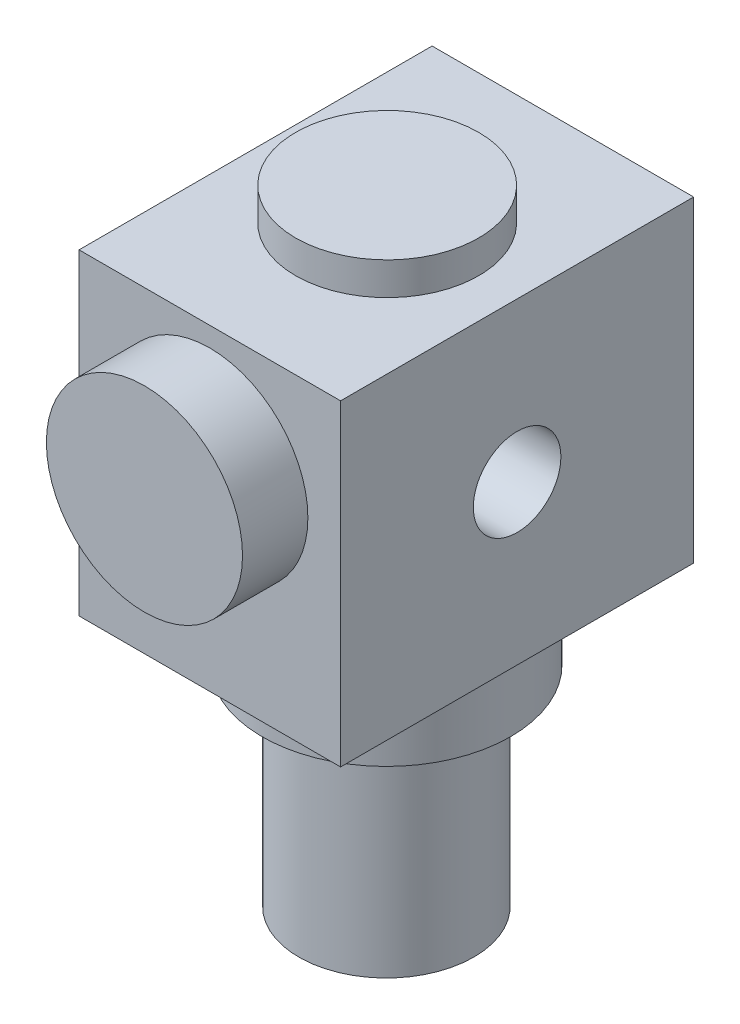
ISO-10303-21;
HEADER;
FILE_DESCRIPTION(('STEP AP214'),'2;1');
FILE_NAME('part.step','',(''),(''),'','','');
FILE_SCHEMA(('AUTOMOTIVE_DESIGN { 1 0 10303 214 1 1 1 1 }'));
ENDSEC;
DATA;
#1=APPLICATION_CONTEXT('core data for automotive mechanical design processes');
#2=APPLICATION_PROTOCOL_DEFINITION('international standard','automotive_design',2000,#1);
#3=PRODUCT_CONTEXT('',#1,'mechanical');
#4=PRODUCT('Part','Part','',(#3));
#5=PRODUCT_RELATED_PRODUCT_CATEGORY('part','',(#4));
#6=PRODUCT_DEFINITION_FORMATION('','',#4);
#7=PRODUCT_DEFINITION_CONTEXT('part definition',#1,'design');
#8=PRODUCT_DEFINITION('design','',#6,#7);
#9=PRODUCT_DEFINITION_SHAPE('','',#8);
#10=(LENGTH_UNIT() NAMED_UNIT(*) SI_UNIT(.MILLI.,.METRE.));
#11=(NAMED_UNIT(*) PLANE_ANGLE_UNIT() SI_UNIT($,.RADIAN.));
#12=(NAMED_UNIT(*) SI_UNIT($,.STERADIAN.) SOLID_ANGLE_UNIT());
#13=UNCERTAINTY_MEASURE_WITH_UNIT(LENGTH_MEASURE(1.E-05),#10,'distance_accuracy_value','');
#14=(GEOMETRIC_REPRESENTATION_CONTEXT(3) GLOBAL_UNCERTAINTY_ASSIGNED_CONTEXT((#13)) GLOBAL_UNIT_ASSIGNED_CONTEXT((#10,
#11,#12)) REPRESENTATION_CONTEXT('',''));
#15=CARTESIAN_POINT('',(0.,0.,0.));
#16=DIRECTION('',(0.,0.,1.));
#17=DIRECTION('',(1.,0.,0.));
#18=AXIS2_PLACEMENT_3D('',#15,#16,#17);
#19=CARTESIAN_POINT('',(-20.,24.25,54.));
#20=DIRECTION('',(0.,-1.,0.));
#21=DIRECTION('',(0.,0.,-1.));
#22=AXIS2_PLACEMENT_3D('',#19,#20,#21);
#23=PLANE('',#22);
#24=CARTESIAN_POINT('',(0.,24.25,26.8732665768881));
#25=DIRECTION('',(0.,1.,0.));
#26=DIRECTION('',(0.,0.,1.));
#27=AXIS2_PLACEMENT_3D('',#24,#25,#26);
#28=CIRCLE('',#27,14.);
#29=CARTESIAN_POINT('',(0.,24.25,40.8732665768881));
#30=VERTEX_POINT('',#29);
#31=EDGE_CURVE('E142',#30,#30,#28,.T.);
#32=ORIENTED_EDGE('',*,*,#31,.F.);
#33=EDGE_LOOP('',(#32));
#34=FACE_BOUND('',#33,.T.);
#35=DIRECTION('',(-1.,0.,0.));
#36=VECTOR('',#35,1.);
#37=CARTESIAN_POINT('',(-20.,24.25,0.));
#38=LINE('',#37,#36);
#39=CARTESIAN_POINT('',(20.,24.25,0.));
#40=VERTEX_POINT('',#39);
#41=CARTESIAN_POINT('',(-20.,24.25,0.));
#42=VERTEX_POINT('',#41);
#43=EDGE_CURVE('E117',#40,#42,#38,.T.);
#44=ORIENTED_EDGE('',*,*,#43,.T.);
#45=DIRECTION('',(0.,0.,-1.));
#46=VECTOR('',#45,1.);
#47=CARTESIAN_POINT('',(-20.,24.25,54.));
#48=LINE('',#47,#46);
#49=CARTESIAN_POINT('',(-20.,24.25,54.));
#50=VERTEX_POINT('',#49);
#51=EDGE_CURVE('E48',#50,#42,#48,.T.);
#52=ORIENTED_EDGE('',*,*,#51,.F.);
#53=DIRECTION('',(-1.,0.,0.));
#54=VECTOR('',#53,1.);
#55=CARTESIAN_POINT('',(-20.,24.25,54.));
#56=LINE('',#55,#54);
#57=CARTESIAN_POINT('',(20.,24.25,54.));
#58=VERTEX_POINT('',#57);
#59=EDGE_CURVE('E100',#58,#50,#56,.T.);
#60=ORIENTED_EDGE('',*,*,#59,.F.);
#61=DIRECTION('',(0.,0.,-1.));
#62=VECTOR('',#61,1.);
#63=CARTESIAN_POINT('',(20.,24.25,54.));
#64=LINE('',#63,#62);
#65=EDGE_CURVE('E113',#58,#40,#64,.T.);
#66=ORIENTED_EDGE('',*,*,#65,.T.);
#67=EDGE_LOOP('',(#44,#52,#60,#66));
#68=FACE_BOUND('',#67,.T.);
#69=ADVANCED_FACE('F45',(#34,#68),#23,.F.);
#70=CARTESIAN_POINT('',(-20.,-24.25,54.));
#71=DIRECTION('',(1.,0.,0.));
#72=DIRECTION('',(0.,0.,-1.));
#73=AXIS2_PLACEMENT_3D('',#70,#71,#72);
#74=PLANE('',#73);
#75=CARTESIAN_POINT('',(-20.,0.,27.));
#76=DIRECTION('',(-1.,0.,0.));
#77=DIRECTION('',(0.,0.,1.));
#78=AXIS2_PLACEMENT_3D('',#75,#76,#77);
#79=CIRCLE('',#78,6.7);
#80=CARTESIAN_POINT('',(-20.,0.,33.7));
#81=VERTEX_POINT('',#80);
#82=EDGE_CURVE('E168',#81,#81,#79,.T.);
#83=ORIENTED_EDGE('',*,*,#82,.F.);
#84=EDGE_LOOP('',(#83));
#85=FACE_BOUND('',#84,.T.);
#86=DIRECTION('',(0.,-1.,0.));
#87=VECTOR('',#86,1.);
#88=CARTESIAN_POINT('',(-20.,-24.25,0.));
#89=LINE('',#88,#87);
#90=CARTESIAN_POINT('',(-20.,-24.25,0.));
#91=VERTEX_POINT('',#90);
#92=EDGE_CURVE('E106',#42,#91,#89,.T.);
#93=ORIENTED_EDGE('',*,*,#92,.T.);
#94=DIRECTION('',(0.,0.,-1.));
#95=VECTOR('',#94,1.);
#96=CARTESIAN_POINT('',(-20.,-24.25,54.));
#97=LINE('',#96,#95);
#98=CARTESIAN_POINT('',(-20.,-24.25,54.));
#99=VERTEX_POINT('',#98);
#100=EDGE_CURVE('E104',#99,#91,#97,.T.);
#101=ORIENTED_EDGE('',*,*,#100,.F.);
#102=DIRECTION('',(0.,-1.,0.));
#103=VECTOR('',#102,1.);
#104=CARTESIAN_POINT('',(-20.,-24.25,54.));
#105=LINE('',#104,#103);
#106=EDGE_CURVE('E95',#50,#99,#105,.T.);
#107=ORIENTED_EDGE('',*,*,#106,.F.);
#108=ORIENTED_EDGE('',*,*,#51,.T.);
#109=EDGE_LOOP('',(#93,#101,#107,#108));
#110=FACE_BOUND('',#109,.T.);
#111=ADVANCED_FACE('F105',(#85,#110),#74,.F.);
#112=CARTESIAN_POINT('',(-20.,-24.25,54.));
#113=DIRECTION('',(0.,1.,0.));
#114=DIRECTION('',(-1.,0.,0.));
#115=AXIS2_PLACEMENT_3D('',#112,#113,#114);
#116=PLANE('',#115);
#117=CARTESIAN_POINT('',(0.,-24.25,27.));
#118=DIRECTION('',(0.,-1.,0.));
#119=DIRECTION('',(1.,0.,0.));
#120=AXIS2_PLACEMENT_3D('',#117,#118,#119);
#121=CIRCLE('',#120,19.);
#122=CARTESIAN_POINT('',(19.,-24.25,27.));
#123=VERTEX_POINT('',#122);
#124=EDGE_CURVE('E55',#123,#123,#121,.T.);
#125=ORIENTED_EDGE('',*,*,#124,.F.);
#126=EDGE_LOOP('',(#125));
#127=FACE_BOUND('',#126,.T.);
#128=DIRECTION('',(1.,0.,0.));
#129=VECTOR('',#128,1.);
#130=CARTESIAN_POINT('',(-20.,-24.25,0.));
#131=LINE('',#130,#129);
#132=CARTESIAN_POINT('',(20.,-24.25,0.));
#133=VERTEX_POINT('',#132);
#134=EDGE_CURVE('E81',#91,#133,#131,.T.);
#135=ORIENTED_EDGE('',*,*,#134,.T.);
#136=DIRECTION('',(0.,0.,-1.));
#137=VECTOR('',#136,1.);
#138=CARTESIAN_POINT('',(20.,-24.25,54.));
#139=LINE('',#138,#137);
#140=CARTESIAN_POINT('',(20.,-24.25,54.));
#141=VERTEX_POINT('',#140);
#142=EDGE_CURVE('E108',#141,#133,#139,.T.);
#143=ORIENTED_EDGE('',*,*,#142,.F.);
#144=DIRECTION('',(1.,0.,0.));
#145=VECTOR('',#144,1.);
#146=CARTESIAN_POINT('',(-20.,-24.25,54.));
#147=LINE('',#146,#145);
#148=EDGE_CURVE('E98',#99,#141,#147,.T.);
#149=ORIENTED_EDGE('',*,*,#148,.F.);
#150=ORIENTED_EDGE('',*,*,#100,.T.);
#151=EDGE_LOOP('',(#135,#143,#149,#150));
#152=FACE_BOUND('',#151,.T.);
#153=ADVANCED_FACE('F109',(#127,#152),#116,.F.);
#154=CARTESIAN_POINT('',(20.,-24.25,54.));
#155=DIRECTION('',(-1.,0.,0.));
#156=DIRECTION('',(0.,0.,1.));
#157=AXIS2_PLACEMENT_3D('',#154,#155,#156);
#158=PLANE('',#157);
#159=CARTESIAN_POINT('',(20.,0.,27.));
#160=DIRECTION('',(1.,0.,0.));
#161=DIRECTION('',(0.,0.,-1.));
#162=AXIS2_PLACEMENT_3D('',#159,#160,#161);
#163=CIRCLE('',#162,6.7);
#164=CARTESIAN_POINT('',(20.,0.,20.3));
#165=VERTEX_POINT('',#164);
#166=EDGE_CURVE('E164',#165,#165,#163,.T.);
#167=ORIENTED_EDGE('',*,*,#166,.F.);
#168=EDGE_LOOP('',(#167));
#169=FACE_BOUND('',#168,.T.);
#170=DIRECTION('',(0.,1.,0.));
#171=VECTOR('',#170,1.);
#172=CARTESIAN_POINT('',(20.,-24.25,0.));
#173=LINE('',#172,#171);
#174=EDGE_CURVE('E87',#133,#40,#173,.T.);
#175=ORIENTED_EDGE('',*,*,#174,.T.);
#176=ORIENTED_EDGE('',*,*,#65,.F.);
#177=DIRECTION('',(0.,1.,0.));
#178=VECTOR('',#177,1.);
#179=CARTESIAN_POINT('',(20.,-24.25,54.));
#180=LINE('',#179,#178);
#181=EDGE_CURVE('E64',#141,#58,#180,.T.);
#182=ORIENTED_EDGE('',*,*,#181,.F.);
#183=ORIENTED_EDGE('',*,*,#142,.T.);
#184=EDGE_LOOP('',(#175,#176,#182,#183));
#185=FACE_BOUND('',#184,.T.);
#186=ADVANCED_FACE('F131',(#169,#185),#158,.F.);
#187=CARTESIAN_POINT('',(0.,0.,54.));
#188=DIRECTION('',(0.,0.,1.));
#189=DIRECTION('',(1.,0.,0.));
#190=AXIS2_PLACEMENT_3D('',#187,#188,#189);
#191=PLANE('',#190);
#192=CARTESIAN_POINT('',(0.,6.24999999999999,54.));
#193=DIRECTION('',(0.,0.,1.));
#194=DIRECTION('',(1.,0.,0.));
#195=AXIS2_PLACEMENT_3D('',#192,#193,#194);
#196=CIRCLE('',#195,15.);
#197=CARTESIAN_POINT('',(15.,6.24999999999999,54.));
#198=VERTEX_POINT('',#197);
#199=EDGE_CURVE('E138',#198,#198,#196,.T.);
#200=ORIENTED_EDGE('',*,*,#199,.F.);
#201=EDGE_LOOP('',(#200));
#202=FACE_BOUND('',#201,.T.);
#203=ORIENTED_EDGE('',*,*,#59,.T.);
#204=ORIENTED_EDGE('',*,*,#106,.T.);
#205=ORIENTED_EDGE('',*,*,#148,.T.);
#206=ORIENTED_EDGE('',*,*,#181,.T.);
#207=EDGE_LOOP('',(#203,#204,#205,#206));
#208=FACE_BOUND('',#207,.T.);
#209=ADVANCED_FACE('F96',(#202,#208),#191,.T.);
#210=CARTESIAN_POINT('',(0.,0.,0.));
#211=DIRECTION('',(0.,0.,1.));
#212=DIRECTION('',(1.,0.,0.));
#213=AXIS2_PLACEMENT_3D('',#210,#211,#212);
#214=PLANE('',#213);
#215=ORIENTED_EDGE('',*,*,#43,.F.);
#216=ORIENTED_EDGE('',*,*,#174,.F.);
#217=ORIENTED_EDGE('',*,*,#134,.F.);
#218=ORIENTED_EDGE('',*,*,#92,.F.);
#219=EDGE_LOOP('',(#215,#216,#217,#218));
#220=FACE_BOUND('',#219,.T.);
#221=ADVANCED_FACE('F134',(#220),#214,.F.);
#222=CARTESIAN_POINT('',(0.,6.24999999999999,64.));
#223=DIRECTION('',(0.,0.,-1.));
#224=DIRECTION('',(-1.,0.,0.));
#225=AXIS2_PLACEMENT_3D('',#222,#223,#224);
#226=CYLINDRICAL_SURFACE('',#225,15.);
#227=CARTESIAN_POINT('',(0.,6.24999999999999,64.));
#228=DIRECTION('',(0.,0.,1.));
#229=DIRECTION('',(1.,0.,0.));
#230=AXIS2_PLACEMENT_3D('',#227,#228,#229);
#231=CIRCLE('',#230,15.);
#232=CARTESIAN_POINT('',(15.,6.24999999999999,64.));
#233=VERTEX_POINT('',#232);
#234=EDGE_CURVE('E121',#233,#233,#231,.T.);
#235=ORIENTED_EDGE('',*,*,#234,.F.);
#236=EDGE_LOOP('',(#235));
#237=FACE_BOUND('',#236,.T.);
#238=ORIENTED_EDGE('',*,*,#199,.T.);
#239=EDGE_LOOP('',(#238));
#240=FACE_BOUND('',#239,.T.);
#241=ADVANCED_FACE('F190',(#237,#240),#226,.T.);
#242=CARTESIAN_POINT('',(0.,6.24999999999999,64.));
#243=DIRECTION('',(0.,0.,1.));
#244=DIRECTION('',(1.,0.,0.));
#245=AXIS2_PLACEMENT_3D('',#242,#243,#244);
#246=PLANE('',#245);
#247=ORIENTED_EDGE('',*,*,#234,.T.);
#248=EDGE_LOOP('',(#247));
#249=FACE_BOUND('',#248,.T.);
#250=ADVANCED_FACE('F196',(#249),#246,.T.);
#251=CARTESIAN_POINT('',(0.,29.25,26.8732665768881));
#252=DIRECTION('',(0.,-1.,0.));
#253=DIRECTION('',(0.,0.,-1.));
#254=AXIS2_PLACEMENT_3D('',#251,#252,#253);
#255=CYLINDRICAL_SURFACE('',#254,14.);
#256=CARTESIAN_POINT('',(0.,29.25,26.8732665768881));
#257=DIRECTION('',(0.,1.,0.));
#258=DIRECTION('',(0.,0.,1.));
#259=AXIS2_PLACEMENT_3D('',#256,#257,#258);
#260=CIRCLE('',#259,14.);
#261=CARTESIAN_POINT('',(0.,29.25,40.8732665768881));
#262=VERTEX_POINT('',#261);
#263=EDGE_CURVE('E146',#262,#262,#260,.T.);
#264=ORIENTED_EDGE('',*,*,#263,.F.);
#265=EDGE_LOOP('',(#264));
#266=FACE_BOUND('',#265,.T.);
#267=ORIENTED_EDGE('',*,*,#31,.T.);
#268=EDGE_LOOP('',(#267));
#269=FACE_BOUND('',#268,.T.);
#270=ADVANCED_FACE('F200',(#266,#269),#255,.T.);
#271=CARTESIAN_POINT('',(0.,29.25,26.8732665768881));
#272=DIRECTION('',(0.,1.,0.));
#273=DIRECTION('',(0.,0.,1.));
#274=AXIS2_PLACEMENT_3D('',#271,#272,#273);
#275=PLANE('',#274);
#276=ORIENTED_EDGE('',*,*,#263,.T.);
#277=EDGE_LOOP('',(#276));
#278=FACE_BOUND('',#277,.T.);
#279=ADVANCED_FACE('F204',(#278),#275,.T.);
#280=CARTESIAN_POINT('',(0.,-34.25,27.));
#281=DIRECTION('',(0.,1.,0.));
#282=DIRECTION('',(-1.,0.,0.));
#283=AXIS2_PLACEMENT_3D('',#280,#281,#282);
#284=CYLINDRICAL_SURFACE('',#283,19.);
#285=CARTESIAN_POINT('',(0.,-34.25,27.));
#286=DIRECTION('',(0.,-1.,0.));
#287=DIRECTION('',(1.,0.,0.));
#288=AXIS2_PLACEMENT_3D('',#285,#286,#287);
#289=CIRCLE('',#288,19.);
#290=CARTESIAN_POINT('',(19.,-34.25,27.));
#291=VERTEX_POINT('',#290);
#292=EDGE_CURVE('E153',#291,#291,#289,.T.);
#293=ORIENTED_EDGE('',*,*,#292,.F.);
#294=EDGE_LOOP('',(#293));
#295=FACE_BOUND('',#294,.T.);
#296=ORIENTED_EDGE('',*,*,#124,.T.);
#297=EDGE_LOOP('',(#296));
#298=FACE_BOUND('',#297,.T.);
#299=ADVANCED_FACE('F208',(#295,#298),#284,.T.);
#300=CARTESIAN_POINT('',(0.,-34.25,27.));
#301=DIRECTION('',(0.,-1.,0.));
#302=DIRECTION('',(1.,0.,0.));
#303=AXIS2_PLACEMENT_3D('',#300,#301,#302);
#304=PLANE('',#303);
#305=CARTESIAN_POINT('',(0.,-34.25,27.));
#306=DIRECTION('',(0.,-1.,0.));
#307=DIRECTION('',(1.,0.,0.));
#308=AXIS2_PLACEMENT_3D('',#305,#306,#307);
#309=CIRCLE('',#308,13.3858838602709);
#310=CARTESIAN_POINT('',(13.3858838602709,-34.25,27.));
#311=VERTEX_POINT('',#310);
#312=EDGE_CURVE('E11',#311,#311,#309,.T.);
#313=ORIENTED_EDGE('',*,*,#312,.F.);
#314=EDGE_LOOP('',(#313));
#315=FACE_BOUND('',#314,.T.);
#316=ORIENTED_EDGE('',*,*,#292,.T.);
#317=EDGE_LOOP('',(#316));
#318=FACE_BOUND('',#317,.T.);
#319=ADVANCED_FACE('F212',(#315,#318),#304,.T.);
#320=CARTESIAN_POINT('',(0.,-66.25,27.));
#321=DIRECTION('',(0.,1.,0.));
#322=DIRECTION('',(-1.,0.,0.));
#323=AXIS2_PLACEMENT_3D('',#320,#321,#322);
#324=CYLINDRICAL_SURFACE('',#323,13.3858838602709);
#325=CARTESIAN_POINT('',(0.,-66.25,27.));
#326=DIRECTION('',(0.,-1.,0.));
#327=DIRECTION('',(1.,0.,0.));
#328=AXIS2_PLACEMENT_3D('',#325,#326,#327);
#329=CIRCLE('',#328,13.3858838602709);
#330=CARTESIAN_POINT('',(13.3858838602709,-66.25,27.));
#331=VERTEX_POINT('',#330);
#332=EDGE_CURVE('E159',#331,#331,#329,.T.);
#333=ORIENTED_EDGE('',*,*,#332,.F.);
#334=EDGE_LOOP('',(#333));
#335=FACE_BOUND('',#334,.T.);
#336=ORIENTED_EDGE('',*,*,#312,.T.);
#337=EDGE_LOOP('',(#336));
#338=FACE_BOUND('',#337,.T.);
#339=ADVANCED_FACE('F216',(#335,#338),#324,.T.);
#340=CARTESIAN_POINT('',(0.,-66.25,27.));
#341=DIRECTION('',(0.,-1.,0.));
#342=DIRECTION('',(1.,0.,0.));
#343=AXIS2_PLACEMENT_3D('',#340,#341,#342);
#344=PLANE('',#343);
#345=ORIENTED_EDGE('',*,*,#332,.T.);
#346=EDGE_LOOP('',(#345));
#347=FACE_BOUND('',#346,.T.);
#348=ADVANCED_FACE('F220',(#347),#344,.T.);
#349=CARTESIAN_POINT('',(0.,0.,27.));
#350=DIRECTION('',(1.,0.,0.));
#351=DIRECTION('',(0.,0.,-1.));
#352=AXIS2_PLACEMENT_3D('',#349,#350,#351);
#353=CYLINDRICAL_SURFACE('',#352,6.7);
#354=ORIENTED_EDGE('',*,*,#166,.T.);
#355=EDGE_LOOP('',(#354));
#356=FACE_BOUND('',#355,.T.);
#357=ORIENTED_EDGE('',*,*,#82,.T.);
#358=EDGE_LOOP('',(#357));
#359=FACE_BOUND('',#358,.T.);
#360=ADVANCED_FACE('F173',(#356,#359),#353,.F.);
#361=CLOSED_SHELL('',(#69,#111,#153,#186,#209,#221,#241,#250,#270,#279,#299,#319,#339,#348,#360));
#362=MANIFOLD_SOLID_BREP('B2',#361);
#363=ADVANCED_BREP_SHAPE_REPRESENTATION('',(#18,#362),#14);
#364=SHAPE_DEFINITION_REPRESENTATION(#9,#363);
ENDSEC;
END-ISO-10303-21;
